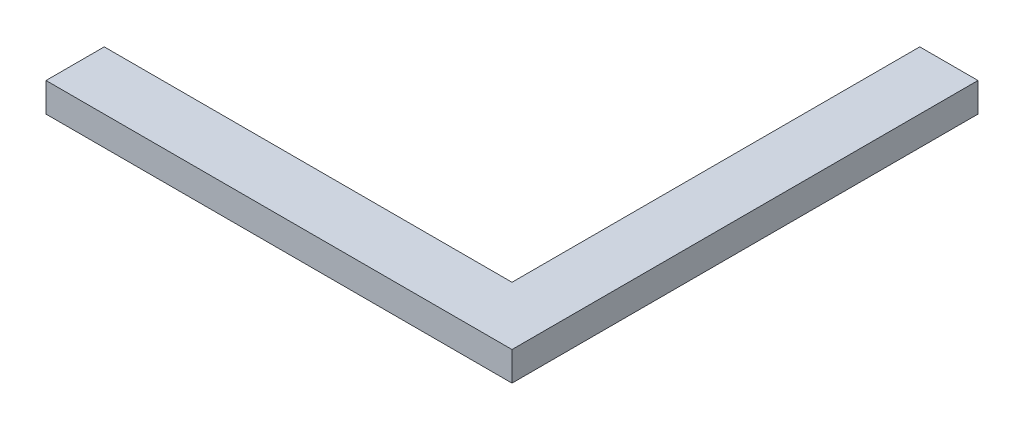
ISO-10303-21;
HEADER;
FILE_DESCRIPTION(('STEP AP214'),'2;1');
FILE_NAME('part.step','',(''),(''),'','','');
FILE_SCHEMA(('AUTOMOTIVE_DESIGN { 1 0 10303 214 1 1 1 1 }'));
ENDSEC;
DATA;
#1=APPLICATION_CONTEXT('core data for automotive mechanical design processes');
#2=APPLICATION_PROTOCOL_DEFINITION('international standard','automotive_design',2000,#1);
#3=PRODUCT_CONTEXT('',#1,'mechanical');
#4=PRODUCT('Part','Part','',(#3));
#5=PRODUCT_RELATED_PRODUCT_CATEGORY('part','',(#4));
#6=PRODUCT_DEFINITION_FORMATION('','',#4);
#7=PRODUCT_DEFINITION_CONTEXT('part definition',#1,'design');
#8=PRODUCT_DEFINITION('design','',#6,#7);
#9=PRODUCT_DEFINITION_SHAPE('','',#8);
#10=(LENGTH_UNIT() NAMED_UNIT(*) SI_UNIT(.MILLI.,.METRE.));
#11=(NAMED_UNIT(*) PLANE_ANGLE_UNIT() SI_UNIT($,.RADIAN.));
#12=(NAMED_UNIT(*) SI_UNIT($,.STERADIAN.) SOLID_ANGLE_UNIT());
#13=UNCERTAINTY_MEASURE_WITH_UNIT(LENGTH_MEASURE(1.E-05),#10,'distance_accuracy_value','');
#14=(GEOMETRIC_REPRESENTATION_CONTEXT(3) GLOBAL_UNCERTAINTY_ASSIGNED_CONTEXT((#13)) GLOBAL_UNIT_ASSIGNED_CONTEXT((#10,
#11,#12)) REPRESENTATION_CONTEXT('',''));
#15=CARTESIAN_POINT('',(0.,0.,0.));
#16=DIRECTION('',(0.,0.,1.));
#17=DIRECTION('',(1.,0.,0.));
#18=AXIS2_PLACEMENT_3D('',#15,#16,#17);
#19=CARTESIAN_POINT('',(80.,10.,80.));
#20=DIRECTION('',(-1.,0.,0.));
#21=DIRECTION('',(0.,0.,1.));
#22=AXIS2_PLACEMENT_3D('',#19,#20,#21);
#23=PLANE('',#22);
#24=DIRECTION('',(0.,0.,-1.));
#25=VECTOR('',#24,1.);
#26=CARTESIAN_POINT('',(80.,0.,80.));
#27=LINE('',#26,#25);
#28=CARTESIAN_POINT('',(80.,0.,80.));
#29=VERTEX_POINT('',#28);
#30=CARTESIAN_POINT('',(80.,0.,-80.));
#31=VERTEX_POINT('',#30);
#32=EDGE_CURVE('E118',#29,#31,#27,.T.);
#33=ORIENTED_EDGE('',*,*,#32,.T.);
#34=DIRECTION('',(0.,-1.,0.));
#35=VECTOR('',#34,1.);
#36=CARTESIAN_POINT('',(80.,10.,-80.));
#37=LINE('',#36,#35);
#38=CARTESIAN_POINT('',(80.,10.,-80.));
#39=VERTEX_POINT('',#38);
#40=EDGE_CURVE('E11',#39,#31,#37,.T.);
#41=ORIENTED_EDGE('',*,*,#40,.F.);
#42=DIRECTION('',(0.,0.,-1.));
#43=VECTOR('',#42,1.);
#44=CARTESIAN_POINT('',(80.,10.,80.));
#45=LINE('',#44,#43);
#46=CARTESIAN_POINT('',(80.,10.,80.));
#47=VERTEX_POINT('',#46);
#48=EDGE_CURVE('E128',#47,#39,#45,.T.);
#49=ORIENTED_EDGE('',*,*,#48,.F.);
#50=DIRECTION('',(0.,-1.,0.));
#51=VECTOR('',#50,1.);
#52=CARTESIAN_POINT('',(80.,10.,80.));
#53=LINE('',#52,#51);
#54=EDGE_CURVE('E114',#47,#29,#53,.T.);
#55=ORIENTED_EDGE('',*,*,#54,.T.);
#56=EDGE_LOOP('',(#33,#41,#49,#55));
#57=FACE_BOUND('',#56,.T.);
#58=ADVANCED_FACE('F34',(#57),#23,.F.);
#59=CARTESIAN_POINT('',(80.,10.,-80.));
#60=DIRECTION('',(0.,0.,1.));
#61=DIRECTION('',(1.,0.,0.));
#62=AXIS2_PLACEMENT_3D('',#59,#60,#61);
#63=PLANE('',#62);
#64=DIRECTION('',(-1.,0.,0.));
#65=VECTOR('',#64,1.);
#66=CARTESIAN_POINT('',(80.,0.,-80.));
#67=LINE('',#66,#65);
#68=CARTESIAN_POINT('',(60.,0.,-80.));
#69=VERTEX_POINT('',#68);
#70=EDGE_CURVE('E121',#31,#69,#67,.T.);
#71=ORIENTED_EDGE('',*,*,#70,.T.);
#72=DIRECTION('',(0.,-1.,0.));
#73=VECTOR('',#72,1.);
#74=CARTESIAN_POINT('',(60.,10.,-80.));
#75=LINE('',#74,#73);
#76=CARTESIAN_POINT('',(60.,10.,-80.));
#77=VERTEX_POINT('',#76);
#78=EDGE_CURVE('E42',#77,#69,#75,.T.);
#79=ORIENTED_EDGE('',*,*,#78,.F.);
#80=DIRECTION('',(-1.,0.,0.));
#81=VECTOR('',#80,1.);
#82=CARTESIAN_POINT('',(80.,10.,-80.));
#83=LINE('',#82,#81);
#84=EDGE_CURVE('E87',#39,#77,#83,.T.);
#85=ORIENTED_EDGE('',*,*,#84,.F.);
#86=ORIENTED_EDGE('',*,*,#40,.T.);
#87=EDGE_LOOP('',(#71,#79,#85,#86));
#88=FACE_BOUND('',#87,.T.);
#89=ADVANCED_FACE('F152',(#88),#63,.F.);
#90=CARTESIAN_POINT('',(60.,10.,-80.));
#91=DIRECTION('',(1.,0.,0.));
#92=DIRECTION('',(0.,0.,-1.));
#93=AXIS2_PLACEMENT_3D('',#90,#91,#92);
#94=PLANE('',#93);
#95=DIRECTION('',(0.,0.,1.));
#96=VECTOR('',#95,1.);
#97=CARTESIAN_POINT('',(60.,0.,-80.));
#98=LINE('',#97,#96);
#99=CARTESIAN_POINT('',(60.,0.,60.));
#100=VERTEX_POINT('',#99);
#101=EDGE_CURVE('E123',#69,#100,#98,.T.);
#102=ORIENTED_EDGE('',*,*,#101,.T.);
#103=DIRECTION('',(0.,-1.,0.));
#104=VECTOR('',#103,1.);
#105=CARTESIAN_POINT('',(60.,10.,60.));
#106=LINE('',#105,#104);
#107=CARTESIAN_POINT('',(60.,10.,60.));
#108=VERTEX_POINT('',#107);
#109=EDGE_CURVE('E109',#108,#100,#106,.T.);
#110=ORIENTED_EDGE('',*,*,#109,.F.);
#111=DIRECTION('',(0.,0.,1.));
#112=VECTOR('',#111,1.);
#113=CARTESIAN_POINT('',(60.,10.,-80.));
#114=LINE('',#113,#112);
#115=EDGE_CURVE('E100',#77,#108,#114,.T.);
#116=ORIENTED_EDGE('',*,*,#115,.F.);
#117=ORIENTED_EDGE('',*,*,#78,.T.);
#118=EDGE_LOOP('',(#102,#110,#116,#117));
#119=FACE_BOUND('',#118,.T.);
#120=ADVANCED_FACE('F134',(#119),#94,.F.);
#121=CARTESIAN_POINT('',(60.,10.,60.));
#122=DIRECTION('',(0.,0.,1.));
#123=DIRECTION('',(1.,0.,0.));
#124=AXIS2_PLACEMENT_3D('',#121,#122,#123);
#125=PLANE('',#124);
#126=DIRECTION('',(-1.,0.,0.));
#127=VECTOR('',#126,1.);
#128=CARTESIAN_POINT('',(60.,0.,60.));
#129=LINE('',#128,#127);
#130=CARTESIAN_POINT('',(-80.,0.,60.));
#131=VERTEX_POINT('',#130);
#132=EDGE_CURVE('E108',#100,#131,#129,.T.);
#133=ORIENTED_EDGE('',*,*,#132,.T.);
#134=DIRECTION('',(0.,-1.,0.));
#135=VECTOR('',#134,1.);
#136=CARTESIAN_POINT('',(-80.,10.,60.));
#137=LINE('',#136,#135);
#138=CARTESIAN_POINT('',(-80.,10.,60.));
#139=VERTEX_POINT('',#138);
#140=EDGE_CURVE('E105',#139,#131,#137,.T.);
#141=ORIENTED_EDGE('',*,*,#140,.F.);
#142=DIRECTION('',(-1.,0.,0.));
#143=VECTOR('',#142,1.);
#144=CARTESIAN_POINT('',(60.,10.,60.));
#145=LINE('',#144,#143);
#146=EDGE_CURVE('E94',#108,#139,#145,.T.);
#147=ORIENTED_EDGE('',*,*,#146,.F.);
#148=ORIENTED_EDGE('',*,*,#109,.T.);
#149=EDGE_LOOP('',(#133,#141,#147,#148));
#150=FACE_BOUND('',#149,.T.);
#151=ADVANCED_FACE('F106',(#150),#125,.F.);
#152=CARTESIAN_POINT('',(-80.,10.,60.));
#153=DIRECTION('',(1.,0.,0.));
#154=DIRECTION('',(0.,0.,-1.));
#155=AXIS2_PLACEMENT_3D('',#152,#153,#154);
#156=PLANE('',#155);
#157=DIRECTION('',(0.,0.,1.));
#158=VECTOR('',#157,1.);
#159=CARTESIAN_POINT('',(-80.,0.,60.));
#160=LINE('',#159,#158);
#161=CARTESIAN_POINT('',(-80.,0.,80.));
#162=VERTEX_POINT('',#161);
#163=EDGE_CURVE('E73',#131,#162,#160,.T.);
#164=ORIENTED_EDGE('',*,*,#163,.T.);
#165=DIRECTION('',(0.,-1.,0.));
#166=VECTOR('',#165,1.);
#167=CARTESIAN_POINT('',(-80.,10.,80.));
#168=LINE('',#167,#166);
#169=CARTESIAN_POINT('',(-80.,10.,80.));
#170=VERTEX_POINT('',#169);
#171=EDGE_CURVE('E110',#170,#162,#168,.T.);
#172=ORIENTED_EDGE('',*,*,#171,.F.);
#173=DIRECTION('',(0.,0.,1.));
#174=VECTOR('',#173,1.);
#175=CARTESIAN_POINT('',(-80.,10.,60.));
#176=LINE('',#175,#174);
#177=EDGE_CURVE('E98',#139,#170,#176,.T.);
#178=ORIENTED_EDGE('',*,*,#177,.F.);
#179=ORIENTED_EDGE('',*,*,#140,.T.);
#180=EDGE_LOOP('',(#164,#172,#178,#179));
#181=FACE_BOUND('',#180,.T.);
#182=ADVANCED_FACE('F112',(#181),#156,.F.);
#183=CARTESIAN_POINT('',(-80.,10.,80.));
#184=DIRECTION('',(0.,0.,-1.));
#185=DIRECTION('',(-1.,0.,0.));
#186=AXIS2_PLACEMENT_3D('',#183,#184,#185);
#187=PLANE('',#186);
#188=DIRECTION('',(1.,0.,0.));
#189=VECTOR('',#188,1.);
#190=CARTESIAN_POINT('',(-80.,0.,80.));
#191=LINE('',#190,#189);
#192=EDGE_CURVE('E79',#162,#29,#191,.T.);
#193=ORIENTED_EDGE('',*,*,#192,.T.);
#194=ORIENTED_EDGE('',*,*,#54,.F.);
#195=DIRECTION('',(1.,0.,0.));
#196=VECTOR('',#195,1.);
#197=CARTESIAN_POINT('',(-80.,10.,80.));
#198=LINE('',#197,#196);
#199=EDGE_CURVE('E50',#170,#47,#198,.T.);
#200=ORIENTED_EDGE('',*,*,#199,.F.);
#201=ORIENTED_EDGE('',*,*,#171,.T.);
#202=EDGE_LOOP('',(#193,#194,#200,#201));
#203=FACE_BOUND('',#202,.T.);
#204=ADVANCED_FACE('F141',(#203),#187,.F.);
#205=CARTESIAN_POINT('',(0.,10.,0.));
#206=DIRECTION('',(0.,1.,0.));
#207=DIRECTION('',(0.,0.,1.));
#208=AXIS2_PLACEMENT_3D('',#205,#206,#207);
#209=PLANE('',#208);
#210=ORIENTED_EDGE('',*,*,#48,.T.);
#211=ORIENTED_EDGE('',*,*,#84,.T.);
#212=ORIENTED_EDGE('',*,*,#115,.T.);
#213=ORIENTED_EDGE('',*,*,#146,.T.);
#214=ORIENTED_EDGE('',*,*,#177,.T.);
#215=ORIENTED_EDGE('',*,*,#199,.T.);
#216=EDGE_LOOP('',(#210,#211,#212,#213,#214,#215));
#217=FACE_BOUND('',#216,.T.);
#218=ADVANCED_FACE('F96',(#217),#209,.T.);
#219=CARTESIAN_POINT('',(0.,0.,0.));
#220=DIRECTION('',(0.,1.,0.));
#221=DIRECTION('',(0.,0.,1.));
#222=AXIS2_PLACEMENT_3D('',#219,#220,#221);
#223=PLANE('',#222);
#224=ORIENTED_EDGE('',*,*,#32,.F.);
#225=ORIENTED_EDGE('',*,*,#192,.F.);
#226=ORIENTED_EDGE('',*,*,#163,.F.);
#227=ORIENTED_EDGE('',*,*,#132,.F.);
#228=ORIENTED_EDGE('',*,*,#101,.F.);
#229=ORIENTED_EDGE('',*,*,#70,.F.);
#230=EDGE_LOOP('',(#224,#225,#226,#227,#228,#229));
#231=FACE_BOUND('',#230,.T.);
#232=ADVANCED_FACE('F137',(#231),#223,.F.);
#233=CLOSED_SHELL('',(#58,#89,#120,#151,#182,#204,#218,#232));
#234=MANIFOLD_SOLID_BREP('B2',#233);
#235=ADVANCED_BREP_SHAPE_REPRESENTATION('',(#18,#234),#14);
#236=SHAPE_DEFINITION_REPRESENTATION(#9,#235);
ENDSEC;
END-ISO-10303-21;
